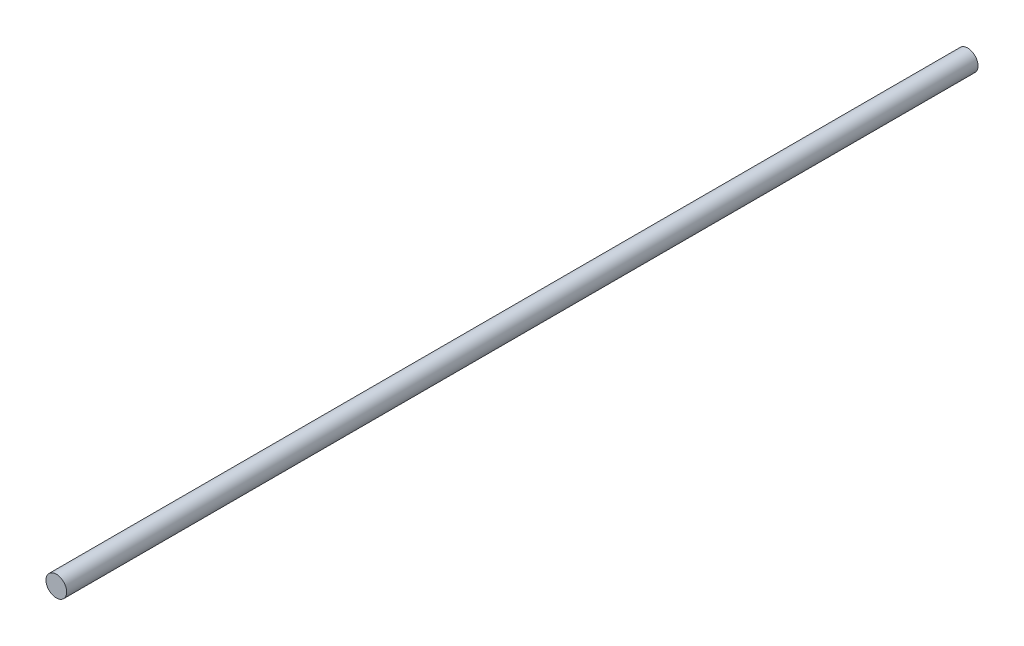
ISO-10303-21;
HEADER;
FILE_DESCRIPTION(('STEP AP214'),'2;1');
FILE_NAME('part.step','',(''),(''),'','','');
FILE_SCHEMA(('AUTOMOTIVE_DESIGN { 1 0 10303 214 1 1 1 1 }'));
ENDSEC;
DATA;
#1=APPLICATION_CONTEXT('core data for automotive mechanical design processes');
#2=APPLICATION_PROTOCOL_DEFINITION('international standard','automotive_design',2000,#1);
#3=PRODUCT_CONTEXT('',#1,'mechanical');
#4=PRODUCT('Part','Part','',(#3));
#5=PRODUCT_RELATED_PRODUCT_CATEGORY('part','',(#4));
#6=PRODUCT_DEFINITION_FORMATION('','',#4);
#7=PRODUCT_DEFINITION_CONTEXT('part definition',#1,'design');
#8=PRODUCT_DEFINITION('design','',#6,#7);
#9=PRODUCT_DEFINITION_SHAPE('','',#8);
#10=(LENGTH_UNIT() NAMED_UNIT(*) SI_UNIT(.MILLI.,.METRE.));
#11=(NAMED_UNIT(*) PLANE_ANGLE_UNIT() SI_UNIT($,.RADIAN.));
#12=(NAMED_UNIT(*) SI_UNIT($,.STERADIAN.) SOLID_ANGLE_UNIT());
#13=UNCERTAINTY_MEASURE_WITH_UNIT(LENGTH_MEASURE(1.E-05),#10,'distance_accuracy_value','');
#14=(GEOMETRIC_REPRESENTATION_CONTEXT(3) GLOBAL_UNCERTAINTY_ASSIGNED_CONTEXT((#13)) GLOBAL_UNIT_ASSIGNED_CONTEXT((#10,
#11,#12)) REPRESENTATION_CONTEXT('',''));
#15=CARTESIAN_POINT('',(0.,0.,0.));
#16=DIRECTION('',(0.,0.,1.));
#17=DIRECTION('',(1.,0.,0.));
#18=AXIS2_PLACEMENT_3D('',#15,#16,#17);
#19=CARTESIAN_POINT('',(0.,0.,350.));
#20=DIRECTION('',(0.,0.,-1.));
#21=DIRECTION('',(-1.,0.,0.));
#22=AXIS2_PLACEMENT_3D('',#19,#20,#21);
#23=CYLINDRICAL_SURFACE('',#22,3.96875);
#24=CARTESIAN_POINT('',(0.,0.,350.));
#25=DIRECTION('',(0.,0.,1.));
#26=DIRECTION('',(1.,0.,0.));
#27=AXIS2_PLACEMENT_3D('',#24,#25,#26);
#28=CIRCLE('',#27,3.96875);
#29=CARTESIAN_POINT('',(3.96875,0.,350.));
#30=VERTEX_POINT('',#29);
#31=EDGE_CURVE('E10',#30,#30,#28,.T.);
#32=ORIENTED_EDGE('',*,*,#31,.F.);
#33=EDGE_LOOP('',(#32));
#34=FACE_BOUND('',#33,.T.);
#35=CARTESIAN_POINT('',(0.,0.,0.));
#36=DIRECTION('',(0.,0.,1.));
#37=DIRECTION('',(1.,0.,0.));
#38=AXIS2_PLACEMENT_3D('',#35,#36,#37);
#39=CIRCLE('',#38,3.96875);
#40=CARTESIAN_POINT('',(3.96875,0.,0.));
#41=VERTEX_POINT('',#40);
#42=EDGE_CURVE('E32',#41,#41,#39,.T.);
#43=ORIENTED_EDGE('',*,*,#42,.T.);
#44=EDGE_LOOP('',(#43));
#45=FACE_BOUND('',#44,.T.);
#46=ADVANCED_FACE('F29',(#34,#45),#23,.T.);
#47=CARTESIAN_POINT('',(0.,0.,350.));
#48=DIRECTION('',(0.,0.,1.));
#49=DIRECTION('',(1.,0.,0.));
#50=AXIS2_PLACEMENT_3D('',#47,#48,#49);
#51=PLANE('',#50);
#52=ORIENTED_EDGE('',*,*,#31,.T.);
#53=EDGE_LOOP('',(#52));
#54=FACE_BOUND('',#53,.T.);
#55=ADVANCED_FACE('F44',(#54),#51,.T.);
#56=CARTESIAN_POINT('',(0.,0.,0.));
#57=DIRECTION('',(0.,0.,1.));
#58=DIRECTION('',(1.,0.,0.));
#59=AXIS2_PLACEMENT_3D('',#56,#57,#58);
#60=PLANE('',#59);
#61=ORIENTED_EDGE('',*,*,#42,.F.);
#62=EDGE_LOOP('',(#61));
#63=FACE_BOUND('',#62,.T.);
#64=ADVANCED_FACE('F42',(#63),#60,.F.);
#65=CLOSED_SHELL('',(#46,#55,#64));
#66=MANIFOLD_SOLID_BREP('B2',#65);
#67=ADVANCED_BREP_SHAPE_REPRESENTATION('',(#18,#66),#14);
#68=SHAPE_DEFINITION_REPRESENTATION(#9,#67);
ENDSEC;
END-ISO-10303-21;
